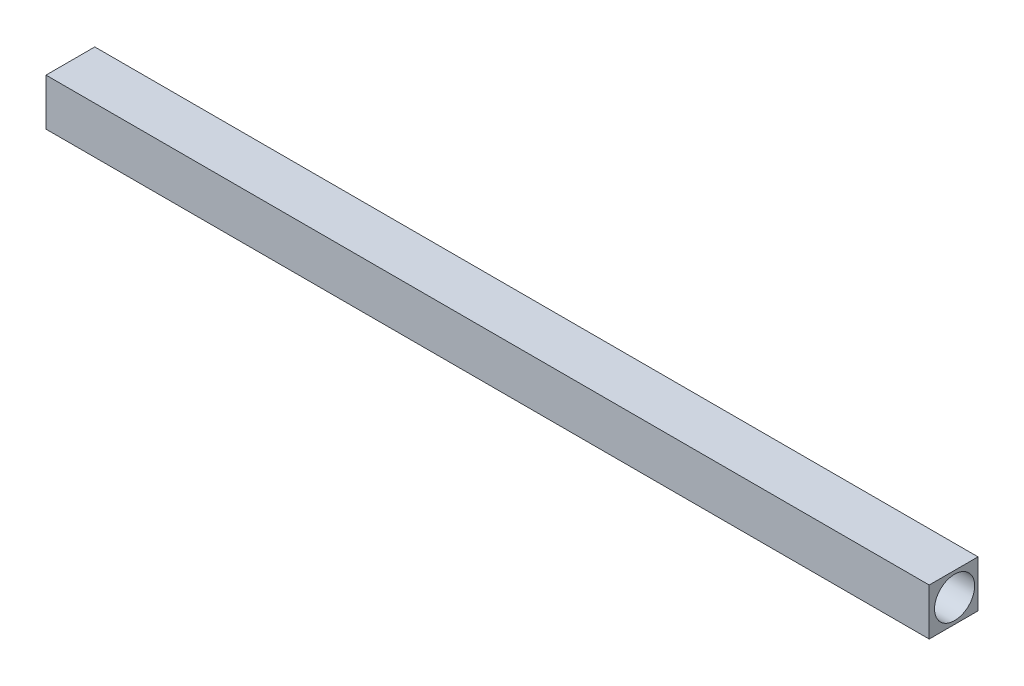
ISO-10303-21;
HEADER;
FILE_DESCRIPTION(('STEP AP214'),'2;1');
FILE_NAME('part.step','',(''),(''),'','','');
FILE_SCHEMA(('AUTOMOTIVE_DESIGN { 1 0 10303 214 1 1 1 1 }'));
ENDSEC;
DATA;
#1=APPLICATION_CONTEXT('core data for automotive mechanical design processes');
#2=APPLICATION_PROTOCOL_DEFINITION('international standard','automotive_design',2000,#1);
#3=PRODUCT_CONTEXT('',#1,'mechanical');
#4=PRODUCT('Part','Part','',(#3));
#5=PRODUCT_RELATED_PRODUCT_CATEGORY('part','',(#4));
#6=PRODUCT_DEFINITION_FORMATION('','',#4);
#7=PRODUCT_DEFINITION_CONTEXT('part definition',#1,'design');
#8=PRODUCT_DEFINITION('design','',#6,#7);
#9=PRODUCT_DEFINITION_SHAPE('','',#8);
#10=(LENGTH_UNIT() NAMED_UNIT(*) SI_UNIT(.MILLI.,.METRE.));
#11=(NAMED_UNIT(*) PLANE_ANGLE_UNIT() SI_UNIT($,.RADIAN.));
#12=(NAMED_UNIT(*) SI_UNIT($,.STERADIAN.) SOLID_ANGLE_UNIT());
#13=UNCERTAINTY_MEASURE_WITH_UNIT(LENGTH_MEASURE(1.E-05),#10,'distance_accuracy_value','');
#14=(GEOMETRIC_REPRESENTATION_CONTEXT(3) GLOBAL_UNCERTAINTY_ASSIGNED_CONTEXT((#13)) GLOBAL_UNIT_ASSIGNED_CONTEXT((#10,
#11,#12)) REPRESENTATION_CONTEXT('',''));
#15=CARTESIAN_POINT('',(0.,0.,0.));
#16=DIRECTION('',(0.,0.,1.));
#17=DIRECTION('',(1.,0.,0.));
#18=AXIS2_PLACEMENT_3D('',#15,#16,#17);
#19=CARTESIAN_POINT('',(-59.3425127184251,35.,0.));
#20=DIRECTION('',(1.,0.,0.));
#21=DIRECTION('',(0.,0.,-1.));
#22=AXIS2_PLACEMENT_3D('',#19,#20,#21);
#23=PLANE('',#22);
#24=CARTESIAN_POINT('',(-59.3425127184252,17.5,17.5));
#25=DIRECTION('',(1.,0.,0.));
#26=DIRECTION('',(0.,0.,-1.));
#27=AXIS2_PLACEMENT_3D('',#24,#25,#26);
#28=CIRCLE('',#27,15.);
#29=CARTESIAN_POINT('',(-59.3425127184252,17.5,2.5));
#30=VERTEX_POINT('',#29);
#31=EDGE_CURVE('E101',#30,#30,#28,.T.);
#32=ORIENTED_EDGE('',*,*,#31,.T.);
#33=EDGE_LOOP('',(#32));
#34=FACE_BOUND('',#33,.T.);
#35=DIRECTION('',(0.,0.,1.));
#36=VECTOR('',#35,1.);
#37=CARTESIAN_POINT('',(-59.3425127184251,0.,0.));
#38=LINE('',#37,#36);
#39=CARTESIAN_POINT('',(-59.3425127184251,0.,0.));
#40=VERTEX_POINT('',#39);
#41=CARTESIAN_POINT('',(-59.3425127184251,0.,36.4583333333333));
#42=VERTEX_POINT('',#41);
#43=EDGE_CURVE('E98',#40,#42,#38,.T.);
#44=ORIENTED_EDGE('',*,*,#43,.T.);
#45=DIRECTION('',(0.,-1.,0.));
#46=VECTOR('',#45,1.);
#47=CARTESIAN_POINT('',(-59.3425127184251,35.,36.4583333333333));
#48=LINE('',#47,#46);
#49=CARTESIAN_POINT('',(-59.3425127184251,35.,36.4583333333333));
#50=VERTEX_POINT('',#49);
#51=EDGE_CURVE('E11',#50,#42,#48,.T.);
#52=ORIENTED_EDGE('',*,*,#51,.F.);
#53=DIRECTION('',(0.,0.,1.));
#54=VECTOR('',#53,1.);
#55=CARTESIAN_POINT('',(-59.3425127184251,35.,0.));
#56=LINE('',#55,#54);
#57=CARTESIAN_POINT('',(-59.3425127184251,35.,0.));
#58=VERTEX_POINT('',#57);
#59=EDGE_CURVE('E86',#58,#50,#56,.T.);
#60=ORIENTED_EDGE('',*,*,#59,.F.);
#61=DIRECTION('',(0.,-1.,0.));
#62=VECTOR('',#61,1.);
#63=CARTESIAN_POINT('',(-59.3425127184251,35.,0.));
#64=LINE('',#63,#62);
#65=EDGE_CURVE('E94',#58,#40,#64,.T.);
#66=ORIENTED_EDGE('',*,*,#65,.T.);
#67=EDGE_LOOP('',(#44,#52,#60,#66));
#68=FACE_BOUND('',#67,.T.);
#69=ADVANCED_FACE('F35',(#34,#68),#23,.F.);
#70=CARTESIAN_POINT('',(-59.3425127184251,35.,36.4583333333333));
#71=DIRECTION('',(0.,0.,-1.));
#72=DIRECTION('',(-1.,0.,0.));
#73=AXIS2_PLACEMENT_3D('',#70,#71,#72);
#74=PLANE('',#73);
#75=DIRECTION('',(1.,0.,0.));
#76=VECTOR('',#75,1.);
#77=CARTESIAN_POINT('',(-59.3425127184251,0.,36.4583333333333));
#78=LINE('',#77,#76);
#79=CARTESIAN_POINT('',(600.657487281575,0.,36.4583333333333));
#80=VERTEX_POINT('',#79);
#81=EDGE_CURVE('E90',#42,#80,#78,.T.);
#82=ORIENTED_EDGE('',*,*,#81,.T.);
#83=DIRECTION('',(0.,-1.,0.));
#84=VECTOR('',#83,1.);
#85=CARTESIAN_POINT('',(600.657487281575,35.,36.4583333333333));
#86=LINE('',#85,#84);
#87=CARTESIAN_POINT('',(600.657487281575,35.,36.4583333333333));
#88=VERTEX_POINT('',#87);
#89=EDGE_CURVE('E43',#88,#80,#86,.T.);
#90=ORIENTED_EDGE('',*,*,#89,.F.);
#91=DIRECTION('',(1.,0.,0.));
#92=VECTOR('',#91,1.);
#93=CARTESIAN_POINT('',(-59.3425127184251,35.,36.4583333333333));
#94=LINE('',#93,#92);
#95=EDGE_CURVE('E81',#50,#88,#94,.T.);
#96=ORIENTED_EDGE('',*,*,#95,.F.);
#97=ORIENTED_EDGE('',*,*,#51,.T.);
#98=EDGE_LOOP('',(#82,#90,#96,#97));
#99=FACE_BOUND('',#98,.T.);
#100=ADVANCED_FACE('F89',(#99),#74,.F.);
#101=CARTESIAN_POINT('',(600.657487281575,35.,0.));
#102=DIRECTION('',(-1.,0.,0.));
#103=DIRECTION('',(0.,0.,1.));
#104=AXIS2_PLACEMENT_3D('',#101,#102,#103);
#105=PLANE('',#104);
#106=CARTESIAN_POINT('',(600.657487281575,17.5,17.5));
#107=DIRECTION('',(1.,0.,0.));
#108=DIRECTION('',(0.,0.,-1.));
#109=AXIS2_PLACEMENT_3D('',#106,#107,#108);
#110=CIRCLE('',#109,15.);
#111=CARTESIAN_POINT('',(600.657487281575,17.5,2.5));
#112=VERTEX_POINT('',#111);
#113=EDGE_CURVE('E112',#112,#112,#110,.T.);
#114=ORIENTED_EDGE('',*,*,#113,.F.);
#115=EDGE_LOOP('',(#114));
#116=FACE_BOUND('',#115,.T.);
#117=DIRECTION('',(0.,0.,-1.));
#118=VECTOR('',#117,1.);
#119=CARTESIAN_POINT('',(600.657487281575,0.,0.));
#120=LINE('',#119,#118);
#121=CARTESIAN_POINT('',(600.657487281575,0.,0.));
#122=VERTEX_POINT('',#121);
#123=EDGE_CURVE('E68',#80,#122,#120,.T.);
#124=ORIENTED_EDGE('',*,*,#123,.T.);
#125=DIRECTION('',(0.,-1.,0.));
#126=VECTOR('',#125,1.);
#127=CARTESIAN_POINT('',(600.657487281575,35.,0.));
#128=LINE('',#127,#126);
#129=CARTESIAN_POINT('',(600.657487281575,35.,0.));
#130=VERTEX_POINT('',#129);
#131=EDGE_CURVE('E91',#130,#122,#128,.T.);
#132=ORIENTED_EDGE('',*,*,#131,.F.);
#133=DIRECTION('',(0.,0.,-1.));
#134=VECTOR('',#133,1.);
#135=CARTESIAN_POINT('',(600.657487281575,35.,0.));
#136=LINE('',#135,#134);
#137=EDGE_CURVE('E84',#88,#130,#136,.T.);
#138=ORIENTED_EDGE('',*,*,#137,.F.);
#139=ORIENTED_EDGE('',*,*,#89,.T.);
#140=EDGE_LOOP('',(#124,#132,#138,#139));
#141=FACE_BOUND('',#140,.T.);
#142=ADVANCED_FACE('F92',(#116,#141),#105,.F.);
#143=CARTESIAN_POINT('',(-59.3425127184251,35.,0.));
#144=DIRECTION('',(0.,0.,1.));
#145=DIRECTION('',(1.,0.,0.));
#146=AXIS2_PLACEMENT_3D('',#143,#144,#145);
#147=PLANE('',#146);
#148=DIRECTION('',(-1.,0.,0.));
#149=VECTOR('',#148,1.);
#150=CARTESIAN_POINT('',(-59.3425127184251,0.,0.));
#151=LINE('',#150,#149);
#152=EDGE_CURVE('E74',#122,#40,#151,.T.);
#153=ORIENTED_EDGE('',*,*,#152,.T.);
#154=ORIENTED_EDGE('',*,*,#65,.F.);
#155=DIRECTION('',(-1.,0.,0.));
#156=VECTOR('',#155,1.);
#157=CARTESIAN_POINT('',(-59.3425127184251,35.,0.));
#158=LINE('',#157,#156);
#159=EDGE_CURVE('E51',#130,#58,#158,.T.);
#160=ORIENTED_EDGE('',*,*,#159,.F.);
#161=ORIENTED_EDGE('',*,*,#131,.T.);
#162=EDGE_LOOP('',(#153,#154,#160,#161));
#163=FACE_BOUND('',#162,.T.);
#164=ADVANCED_FACE('F106',(#163),#147,.F.);
#165=CARTESIAN_POINT('',(0.,35.,0.));
#166=DIRECTION('',(0.,1.,0.));
#167=DIRECTION('',(0.,0.,1.));
#168=AXIS2_PLACEMENT_3D('',#165,#166,#167);
#169=PLANE('',#168);
#170=ORIENTED_EDGE('',*,*,#59,.T.);
#171=ORIENTED_EDGE('',*,*,#95,.T.);
#172=ORIENTED_EDGE('',*,*,#137,.T.);
#173=ORIENTED_EDGE('',*,*,#159,.T.);
#174=EDGE_LOOP('',(#170,#171,#172,#173));
#175=FACE_BOUND('',#174,.T.);
#176=ADVANCED_FACE('F82',(#175),#169,.T.);
#177=CARTESIAN_POINT('',(0.,0.,0.));
#178=DIRECTION('',(0.,1.,0.));
#179=DIRECTION('',(0.,0.,1.));
#180=AXIS2_PLACEMENT_3D('',#177,#178,#179);
#181=PLANE('',#180);
#182=ORIENTED_EDGE('',*,*,#43,.F.);
#183=ORIENTED_EDGE('',*,*,#152,.F.);
#184=ORIENTED_EDGE('',*,*,#123,.F.);
#185=ORIENTED_EDGE('',*,*,#81,.F.);
#186=EDGE_LOOP('',(#182,#183,#184,#185));
#187=FACE_BOUND('',#186,.T.);
#188=ADVANCED_FACE('F109',(#187),#181,.F.);
#189=CARTESIAN_POINT('',(-59.3425127184252,17.5,17.5));
#190=DIRECTION('',(1.,0.,0.));
#191=DIRECTION('',(0.,0.,-1.));
#192=AXIS2_PLACEMENT_3D('',#189,#190,#191);
#193=CYLINDRICAL_SURFACE('',#192,15.);
#194=ORIENTED_EDGE('',*,*,#31,.F.);
#195=EDGE_LOOP('',(#194));
#196=FACE_BOUND('',#195,.T.);
#197=ORIENTED_EDGE('',*,*,#113,.T.);
#198=EDGE_LOOP('',(#197));
#199=FACE_BOUND('',#198,.T.);
#200=ADVANCED_FACE('F119',(#196,#199),#193,.F.);
#201=CLOSED_SHELL('',(#69,#100,#142,#164,#176,#188,#200));
#202=MANIFOLD_SOLID_BREP('B2',#201);
#203=ADVANCED_BREP_SHAPE_REPRESENTATION('',(#18,#202),#14);
#204=SHAPE_DEFINITION_REPRESENTATION(#9,#203);
ENDSEC;
END-ISO-10303-21;
